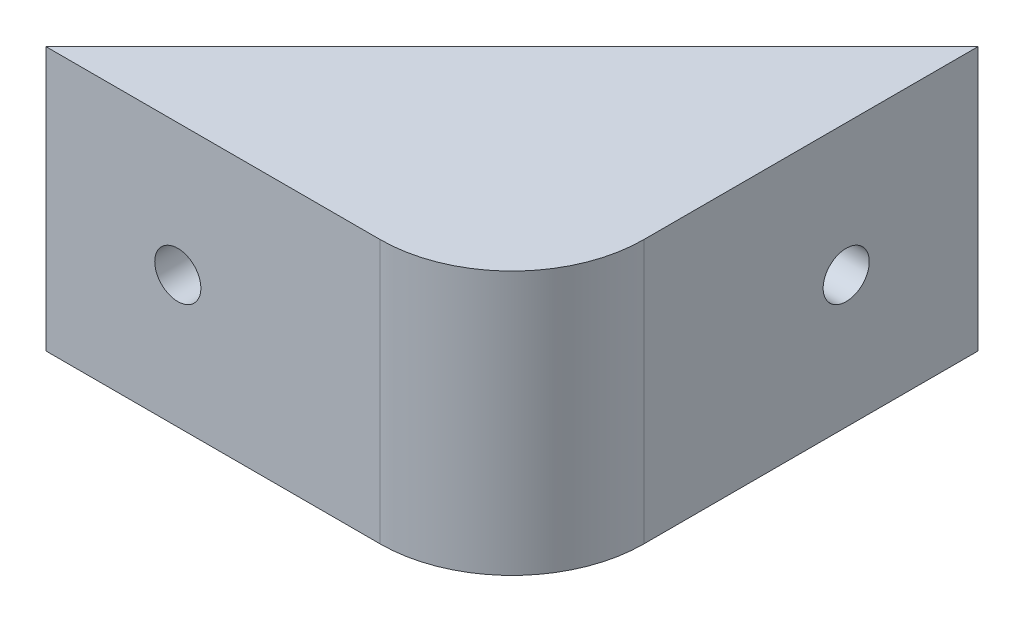
ISO-10303-21;
HEADER;
FILE_DESCRIPTION(('STEP AP214'),'2;1');
FILE_NAME('part.step','',(''),(''),'','','');
FILE_SCHEMA(('AUTOMOTIVE_DESIGN { 1 0 10303 214 1 1 1 1 }'));
ENDSEC;
DATA;
#1=APPLICATION_CONTEXT('core data for automotive mechanical design processes');
#2=APPLICATION_PROTOCOL_DEFINITION('international standard','automotive_design',2000,#1);
#3=PRODUCT_CONTEXT('',#1,'mechanical');
#4=PRODUCT('Part','Part','',(#3));
#5=PRODUCT_RELATED_PRODUCT_CATEGORY('part','',(#4));
#6=PRODUCT_DEFINITION_FORMATION('','',#4);
#7=PRODUCT_DEFINITION_CONTEXT('part definition',#1,'design');
#8=PRODUCT_DEFINITION('design','',#6,#7);
#9=PRODUCT_DEFINITION_SHAPE('','',#8);
#10=(LENGTH_UNIT() NAMED_UNIT(*) SI_UNIT(.MILLI.,.METRE.));
#11=(NAMED_UNIT(*) PLANE_ANGLE_UNIT() SI_UNIT($,.RADIAN.));
#12=(NAMED_UNIT(*) SI_UNIT($,.STERADIAN.) SOLID_ANGLE_UNIT());
#13=UNCERTAINTY_MEASURE_WITH_UNIT(LENGTH_MEASURE(1.E-05),#10,'distance_accuracy_value','');
#14=(GEOMETRIC_REPRESENTATION_CONTEXT(3) GLOBAL_UNCERTAINTY_ASSIGNED_CONTEXT((#13)) GLOBAL_UNIT_ASSIGNED_CONTEXT((#10,
#11,#12)) REPRESENTATION_CONTEXT('',''));
#15=CARTESIAN_POINT('',(0.,0.,0.));
#16=DIRECTION('',(0.,0.,1.));
#17=DIRECTION('',(1.,0.,0.));
#18=AXIS2_PLACEMENT_3D('',#15,#16,#17);
#19=CARTESIAN_POINT('',(-35.3553390593276,10.,0.));
#20=DIRECTION('',(0.,0.,-1.));
#21=DIRECTION('',(-1.,0.,0.));
#22=AXIS2_PLACEMENT_3D('',#19,#20,#21);
#23=PLANE('',#22);
#24=CARTESIAN_POINT('',(-25.3553390593276,0.,0.));
#25=DIRECTION('',(0.,0.,-1.));
#26=DIRECTION('',(-1.,0.,0.));
#27=AXIS2_PLACEMENT_3D('',#24,#25,#26);
#28=CIRCLE('',#27,1.75);
#29=CARTESIAN_POINT('',(-27.1053390593276,0.,0.));
#30=VERTEX_POINT('',#29);
#31=EDGE_CURVE('E284',#30,#30,#28,.T.);
#32=ORIENTED_EDGE('',*,*,#31,.T.);
#33=EDGE_LOOP('',(#32));
#34=FACE_BOUND('',#33,.T.);
#35=DIRECTION('',(1.,0.,0.));
#36=VECTOR('',#35,1.);
#37=CARTESIAN_POINT('',(-35.3553390593276,-10.,0.));
#38=LINE('',#37,#36);
#39=CARTESIAN_POINT('',(-35.3553390593276,-10.,0.));
#40=VERTEX_POINT('',#39);
#41=CARTESIAN_POINT('',(-10.,-10.,0.));
#42=VERTEX_POINT('',#41);
#43=EDGE_CURVE('E124',#40,#42,#38,.T.);
#44=ORIENTED_EDGE('',*,*,#43,.T.);
#45=DIRECTION('',(0.,-1.,0.));
#46=VECTOR('',#45,1.);
#47=CARTESIAN_POINT('',(-10.,10.,0.));
#48=LINE('',#47,#46);
#49=CARTESIAN_POINT('',(-10.,10.,0.));
#50=VERTEX_POINT('',#49);
#51=EDGE_CURVE('E57',#42,#50,#48,.F.);
#52=ORIENTED_EDGE('',*,*,#51,.T.);
#53=DIRECTION('',(1.,0.,0.));
#54=VECTOR('',#53,1.);
#55=CARTESIAN_POINT('',(-35.3553390593276,10.,0.));
#56=LINE('',#55,#54);
#57=CARTESIAN_POINT('',(-35.3553390593276,10.,0.));
#58=VERTEX_POINT('',#57);
#59=EDGE_CURVE('E128',#58,#50,#56,.T.);
#60=ORIENTED_EDGE('',*,*,#59,.F.);
#61=DIRECTION('',(0.,-1.,0.));
#62=VECTOR('',#61,1.);
#63=CARTESIAN_POINT('',(-35.3553390593276,10.,0.));
#64=LINE('',#63,#62);
#65=EDGE_CURVE('E135',#58,#40,#64,.T.);
#66=ORIENTED_EDGE('',*,*,#65,.T.);
#67=EDGE_LOOP('',(#44,#52,#60,#66));
#68=FACE_BOUND('',#67,.T.);
#69=ADVANCED_FACE('F34',(#34,#68),#23,.F.);
#70=CARTESIAN_POINT('',(0.,10.,0.));
#71=DIRECTION('',(-1.,0.,0.));
#72=DIRECTION('',(0.,0.,1.));
#73=AXIS2_PLACEMENT_3D('',#70,#71,#72);
#74=PLANE('',#73);
#75=CARTESIAN_POINT('',(0.,0.,-25.3553390593272));
#76=DIRECTION('',(-1.,0.,0.));
#77=DIRECTION('',(0.,0.,1.));
#78=AXIS2_PLACEMENT_3D('',#75,#76,#77);
#79=CIRCLE('',#78,1.75);
#80=CARTESIAN_POINT('',(0.,0.,-23.6053390593272));
#81=VERTEX_POINT('',#80);
#82=EDGE_CURVE('E112',#81,#81,#79,.T.);
#83=ORIENTED_EDGE('',*,*,#82,.T.);
#84=EDGE_LOOP('',(#83));
#85=FACE_BOUND('',#84,.T.);
#86=DIRECTION('',(0.,0.,-1.));
#87=VECTOR('',#86,1.);
#88=CARTESIAN_POINT('',(0.,10.,0.));
#89=LINE('',#88,#87);
#90=CARTESIAN_POINT('',(0.,10.,-10.));
#91=VERTEX_POINT('',#90);
#92=CARTESIAN_POINT('',(0.,10.,-35.3553390593272));
#93=VERTEX_POINT('',#92);
#94=EDGE_CURVE('E130',#91,#93,#89,.T.);
#95=ORIENTED_EDGE('',*,*,#94,.F.);
#96=DIRECTION('',(0.,-1.,0.));
#97=VECTOR('',#96,1.);
#98=CARTESIAN_POINT('',(0.,10.,-10.));
#99=LINE('',#98,#97);
#100=CARTESIAN_POINT('',(0.,-10.,-10.));
#101=VERTEX_POINT('',#100);
#102=EDGE_CURVE('E145',#91,#101,#99,.T.);
#103=ORIENTED_EDGE('',*,*,#102,.T.);
#104=DIRECTION('',(0.,0.,-1.));
#105=VECTOR('',#104,1.);
#106=CARTESIAN_POINT('',(0.,-10.,0.));
#107=LINE('',#106,#105);
#108=CARTESIAN_POINT('',(0.,-10.,-35.3553390593272));
#109=VERTEX_POINT('',#108);
#110=EDGE_CURVE('E137',#101,#109,#107,.T.);
#111=ORIENTED_EDGE('',*,*,#110,.T.);
#112=DIRECTION('',(0.,-1.,0.));
#113=VECTOR('',#112,1.);
#114=CARTESIAN_POINT('',(0.,10.,-35.3553390593272));
#115=LINE('',#114,#113);
#116=EDGE_CURVE('E142',#93,#109,#115,.T.);
#117=ORIENTED_EDGE('',*,*,#116,.F.);
#118=EDGE_LOOP('',(#95,#103,#111,#117));
#119=FACE_BOUND('',#118,.T.);
#120=ADVANCED_FACE('F183',(#85,#119),#74,.F.);
#121=CARTESIAN_POINT('',(0.,10.,-35.3553390593272));
#122=DIRECTION('',(0.707106781186544,0.,0.707106781186551));
#123=DIRECTION('',(0.707106781186551,0.,-0.707106781186544));
#124=AXIS2_PLACEMENT_3D('',#121,#122,#123);
#125=PLANE('',#124);
#126=DIRECTION('',(0.,1.,0.));
#127=VECTOR('',#126,1.);
#128=CARTESIAN_POINT('',(-5.,10.,-30.3553390593272));
#129=LINE('',#128,#127);
#130=CARTESIAN_POINT('',(-5.,-7.5,-30.3553390593272));
#131=VERTEX_POINT('',#130);
#132=CARTESIAN_POINT('',(-5.,7.5,-30.3553390593272));
#133=VERTEX_POINT('',#132);
#134=EDGE_CURVE('E11',#131,#133,#129,.T.);
#135=ORIENTED_EDGE('',*,*,#134,.T.);
#136=DIRECTION('',(-0.707106781186551,0.,0.707106781186544));
#137=VECTOR('',#136,1.);
#138=CARTESIAN_POINT('',(0.,7.5,-35.3553390593272));
#139=LINE('',#138,#137);
#140=CARTESIAN_POINT('',(-30.3553390593275,7.5,-5.));
#141=VERTEX_POINT('',#140);
#142=EDGE_CURVE('E42',#133,#141,#139,.T.);
#143=ORIENTED_EDGE('',*,*,#142,.T.);
#144=DIRECTION('',(0.,-1.,0.));
#145=VECTOR('',#144,1.);
#146=CARTESIAN_POINT('',(-30.3553390593275,10.,-5.));
#147=LINE('',#146,#145);
#148=CARTESIAN_POINT('',(-30.3553390593275,-7.5,-5.));
#149=VERTEX_POINT('',#148);
#150=EDGE_CURVE('E153',#141,#149,#147,.T.);
#151=ORIENTED_EDGE('',*,*,#150,.T.);
#152=DIRECTION('',(0.707106781186551,0.,-0.707106781186544));
#153=VECTOR('',#152,1.);
#154=CARTESIAN_POINT('',(0.,-7.5,-35.3553390593272));
#155=LINE('',#154,#153);
#156=EDGE_CURVE('E115',#149,#131,#155,.T.);
#157=ORIENTED_EDGE('',*,*,#156,.T.);
#158=EDGE_LOOP('',(#135,#143,#151,#157));
#159=FACE_BOUND('',#158,.T.);
#160=DIRECTION('',(-0.707106781186551,0.,0.707106781186544));
#161=VECTOR('',#160,1.);
#162=CARTESIAN_POINT('',(0.,-10.,-35.3553390593272));
#163=LINE('',#162,#161);
#164=EDGE_CURVE('E131',#109,#40,#163,.T.);
#165=ORIENTED_EDGE('',*,*,#164,.T.);
#166=ORIENTED_EDGE('',*,*,#65,.F.);
#167=DIRECTION('',(-0.707106781186551,0.,0.707106781186544));
#168=VECTOR('',#167,1.);
#169=CARTESIAN_POINT('',(0.,10.,-35.3553390593272));
#170=LINE('',#169,#168);
#171=EDGE_CURVE('E133',#93,#58,#170,.T.);
#172=ORIENTED_EDGE('',*,*,#171,.F.);
#173=ORIENTED_EDGE('',*,*,#116,.T.);
#174=EDGE_LOOP('',(#165,#166,#172,#173));
#175=FACE_BOUND('',#174,.T.);
#176=ADVANCED_FACE('F156',(#159,#175),#125,.F.);
#177=CARTESIAN_POINT('',(0.,10.,0.));
#178=DIRECTION('',(0.,1.,0.));
#179=DIRECTION('',(0.,0.,1.));
#180=AXIS2_PLACEMENT_3D('',#177,#178,#179);
#181=PLANE('',#180);
#182=ORIENTED_EDGE('',*,*,#59,.T.);
#183=CARTESIAN_POINT('',(-10.,10.,-10.));
#184=DIRECTION('',(0.,1.,0.));
#185=DIRECTION('',(0.,0.,1.));
#186=AXIS2_PLACEMENT_3D('',#183,#184,#185);
#187=CIRCLE('',#186,10.);
#188=EDGE_CURVE('E151',#50,#91,#187,.T.);
#189=ORIENTED_EDGE('',*,*,#188,.T.);
#190=ORIENTED_EDGE('',*,*,#94,.T.);
#191=ORIENTED_EDGE('',*,*,#171,.T.);
#192=EDGE_LOOP('',(#182,#189,#190,#191));
#193=FACE_BOUND('',#192,.T.);
#194=ADVANCED_FACE('F194',(#193),#181,.T.);
#195=CARTESIAN_POINT('',(0.,-10.,0.));
#196=DIRECTION('',(0.,1.,0.));
#197=DIRECTION('',(0.,0.,1.));
#198=AXIS2_PLACEMENT_3D('',#195,#196,#197);
#199=PLANE('',#198);
#200=ORIENTED_EDGE('',*,*,#110,.F.);
#201=CARTESIAN_POINT('',(-10.,-10.,-10.));
#202=DIRECTION('',(0.,1.,0.));
#203=DIRECTION('',(0.,0.,1.));
#204=AXIS2_PLACEMENT_3D('',#201,#202,#203);
#205=CIRCLE('',#204,10.);
#206=EDGE_CURVE('E148',#101,#42,#205,.F.);
#207=ORIENTED_EDGE('',*,*,#206,.T.);
#208=ORIENTED_EDGE('',*,*,#43,.F.);
#209=ORIENTED_EDGE('',*,*,#164,.F.);
#210=EDGE_LOOP('',(#200,#207,#208,#209));
#211=FACE_BOUND('',#210,.T.);
#212=ADVANCED_FACE('F195',(#211),#199,.F.);
#213=CARTESIAN_POINT('',(-10.,10.,-10.));
#214=DIRECTION('',(0.,-1.,0.));
#215=DIRECTION('',(0.,0.,-1.));
#216=AXIS2_PLACEMENT_3D('',#213,#214,#215);
#217=CYLINDRICAL_SURFACE('',#216,10.);
#218=ORIENTED_EDGE('',*,*,#188,.F.);
#219=ORIENTED_EDGE('',*,*,#51,.F.);
#220=ORIENTED_EDGE('',*,*,#206,.F.);
#221=ORIENTED_EDGE('',*,*,#102,.F.);
#222=EDGE_LOOP('',(#218,#219,#220,#221));
#223=FACE_BOUND('',#222,.T.);
#224=ADVANCED_FACE('F36',(#223),#217,.T.);
#225=CARTESIAN_POINT('',(-35.3553390593276,7.5,-35.3553390593272));
#226=DIRECTION('',(0.,1.,0.));
#227=DIRECTION('',(0.,0.,1.));
#228=AXIS2_PLACEMENT_3D('',#225,#226,#227);
#229=PLANE('',#228);
#230=DIRECTION('',(0.,0.,1.));
#231=VECTOR('',#230,1.);
#232=CARTESIAN_POINT('',(-5.,7.5,-10.));
#233=LINE('',#232,#231);
#234=CARTESIAN_POINT('',(-5.,7.5,-10.));
#235=VERTEX_POINT('',#234);
#236=EDGE_CURVE('E117',#133,#235,#233,.T.);
#237=ORIENTED_EDGE('',*,*,#236,.T.);
#238=CARTESIAN_POINT('',(-10.,7.5,-10.));
#239=DIRECTION('',(0.,-1.,0.));
#240=DIRECTION('',(0.,0.,-1.));
#241=AXIS2_PLACEMENT_3D('',#238,#239,#240);
#242=CIRCLE('',#241,5.);
#243=CARTESIAN_POINT('',(-10.,7.5,-5.));
#244=VERTEX_POINT('',#243);
#245=EDGE_CURVE('E111',#235,#244,#242,.T.);
#246=ORIENTED_EDGE('',*,*,#245,.T.);
#247=DIRECTION('',(-1.,0.,0.));
#248=VECTOR('',#247,1.);
#249=CARTESIAN_POINT('',(-35.3553390593276,7.5,-5.));
#250=LINE('',#249,#248);
#251=EDGE_CURVE('E122',#244,#141,#250,.T.);
#252=ORIENTED_EDGE('',*,*,#251,.T.);
#253=ORIENTED_EDGE('',*,*,#142,.F.);
#254=EDGE_LOOP('',(#237,#246,#252,#253));
#255=FACE_BOUND('',#254,.T.);
#256=ADVANCED_FACE('F162',(#255),#229,.F.);
#257=CARTESIAN_POINT('',(-35.3553390593276,-7.5,-35.3553390593272));
#258=DIRECTION('',(0.,-1.,0.));
#259=DIRECTION('',(0.,0.,-1.));
#260=AXIS2_PLACEMENT_3D('',#257,#258,#259);
#261=PLANE('',#260);
#262=DIRECTION('',(1.,0.,0.));
#263=VECTOR('',#262,1.);
#264=CARTESIAN_POINT('',(-35.3553390593276,-7.5,-5.));
#265=LINE('',#264,#263);
#266=CARTESIAN_POINT('',(-10.,-7.5,-5.));
#267=VERTEX_POINT('',#266);
#268=EDGE_CURVE('E49',#149,#267,#265,.T.);
#269=ORIENTED_EDGE('',*,*,#268,.T.);
#270=CARTESIAN_POINT('',(-10.,-7.5,-10.));
#271=DIRECTION('',(0.,-1.,0.));
#272=DIRECTION('',(0.,0.,-1.));
#273=AXIS2_PLACEMENT_3D('',#270,#271,#272);
#274=CIRCLE('',#273,5.);
#275=CARTESIAN_POINT('',(-5.,-7.5,-10.));
#276=VERTEX_POINT('',#275);
#277=EDGE_CURVE('E102',#276,#267,#274,.T.);
#278=ORIENTED_EDGE('',*,*,#277,.F.);
#279=DIRECTION('',(0.,0.,-1.));
#280=VECTOR('',#279,1.);
#281=CARTESIAN_POINT('',(-5.,-7.5,-10.));
#282=LINE('',#281,#280);
#283=EDGE_CURVE('E164',#276,#131,#282,.T.);
#284=ORIENTED_EDGE('',*,*,#283,.T.);
#285=ORIENTED_EDGE('',*,*,#156,.F.);
#286=EDGE_LOOP('',(#269,#278,#284,#285));
#287=FACE_BOUND('',#286,.T.);
#288=ADVANCED_FACE('F114',(#287),#261,.F.);
#289=CARTESIAN_POINT('',(0.,0.,-5.));
#290=DIRECTION('',(0.,0.,1.));
#291=DIRECTION('',(1.,0.,0.));
#292=AXIS2_PLACEMENT_3D('',#289,#290,#291);
#293=PLANE('',#292);
#294=CARTESIAN_POINT('',(-25.3553390593276,0.,-5.));
#295=DIRECTION('',(0.,0.,-1.));
#296=DIRECTION('',(-1.,0.,0.));
#297=AXIS2_PLACEMENT_3D('',#294,#295,#296);
#298=CIRCLE('',#297,1.75);
#299=CARTESIAN_POINT('',(-27.1053390593276,0.,-5.));
#300=VERTEX_POINT('',#299);
#301=EDGE_CURVE('E287',#300,#300,#298,.T.);
#302=ORIENTED_EDGE('',*,*,#301,.F.);
#303=EDGE_LOOP('',(#302));
#304=FACE_BOUND('',#303,.T.);
#305=ORIENTED_EDGE('',*,*,#251,.F.);
#306=DIRECTION('',(0.,1.,0.));
#307=VECTOR('',#306,1.);
#308=CARTESIAN_POINT('',(-10.,7.5,-5.));
#309=LINE('',#308,#307);
#310=EDGE_CURVE('E104',#267,#244,#309,.T.);
#311=ORIENTED_EDGE('',*,*,#310,.F.);
#312=ORIENTED_EDGE('',*,*,#268,.F.);
#313=ORIENTED_EDGE('',*,*,#150,.F.);
#314=EDGE_LOOP('',(#305,#311,#312,#313));
#315=FACE_BOUND('',#314,.T.);
#316=ADVANCED_FACE('F120',(#304,#315),#293,.F.);
#317=CARTESIAN_POINT('',(-5.,0.,0.));
#318=DIRECTION('',(1.,0.,0.));
#319=DIRECTION('',(0.,0.,-1.));
#320=AXIS2_PLACEMENT_3D('',#317,#318,#319);
#321=PLANE('',#320);
#322=CARTESIAN_POINT('',(-5.,0.,-25.3553390593272));
#323=DIRECTION('',(-1.,0.,0.));
#324=DIRECTION('',(0.,0.,1.));
#325=AXIS2_PLACEMENT_3D('',#322,#323,#324);
#326=CIRCLE('',#325,1.75);
#327=CARTESIAN_POINT('',(-5.,0.,-23.6053390593272));
#328=VERTEX_POINT('',#327);
#329=EDGE_CURVE('E289',#328,#328,#326,.T.);
#330=ORIENTED_EDGE('',*,*,#329,.F.);
#331=EDGE_LOOP('',(#330));
#332=FACE_BOUND('',#331,.T.);
#333=ORIENTED_EDGE('',*,*,#283,.F.);
#334=DIRECTION('',(0.,-1.,0.));
#335=VECTOR('',#334,1.);
#336=CARTESIAN_POINT('',(-5.,7.5,-10.));
#337=LINE('',#336,#335);
#338=EDGE_CURVE('E107',#235,#276,#337,.T.);
#339=ORIENTED_EDGE('',*,*,#338,.F.);
#340=ORIENTED_EDGE('',*,*,#236,.F.);
#341=ORIENTED_EDGE('',*,*,#134,.F.);
#342=EDGE_LOOP('',(#333,#339,#340,#341));
#343=FACE_BOUND('',#342,.T.);
#344=ADVANCED_FACE('F169',(#332,#343),#321,.F.);
#345=CARTESIAN_POINT('',(-10.,-7.5,-10.));
#346=DIRECTION('',(0.,-1.,0.));
#347=DIRECTION('',(0.,0.,-1.));
#348=AXIS2_PLACEMENT_3D('',#345,#346,#347);
#349=CYLINDRICAL_SURFACE('',#348,5.);
#350=ORIENTED_EDGE('',*,*,#310,.T.);
#351=ORIENTED_EDGE('',*,*,#245,.F.);
#352=ORIENTED_EDGE('',*,*,#338,.T.);
#353=ORIENTED_EDGE('',*,*,#277,.T.);
#354=EDGE_LOOP('',(#350,#351,#352,#353));
#355=FACE_BOUND('',#354,.T.);
#356=ADVANCED_FACE('F103',(#355),#349,.F.);
#357=CARTESIAN_POINT('',(0.,0.,-25.3553390593272));
#358=DIRECTION('',(-1.,0.,0.));
#359=DIRECTION('',(0.,0.,1.));
#360=AXIS2_PLACEMENT_3D('',#357,#358,#359);
#361=CYLINDRICAL_SURFACE('',#360,1.75);
#362=ORIENTED_EDGE('',*,*,#82,.F.);
#363=EDGE_LOOP('',(#362));
#364=FACE_BOUND('',#363,.T.);
#365=ORIENTED_EDGE('',*,*,#329,.T.);
#366=EDGE_LOOP('',(#365));
#367=FACE_BOUND('',#366,.T.);
#368=ADVANCED_FACE('F177',(#364,#367),#361,.F.);
#369=CARTESIAN_POINT('',(-25.3553390593276,0.,0.));
#370=DIRECTION('',(0.,0.,-1.));
#371=DIRECTION('',(-1.,0.,0.));
#372=AXIS2_PLACEMENT_3D('',#369,#370,#371);
#373=CYLINDRICAL_SURFACE('',#372,1.75);
#374=ORIENTED_EDGE('',*,*,#31,.F.);
#375=EDGE_LOOP('',(#374));
#376=FACE_BOUND('',#375,.T.);
#377=ORIENTED_EDGE('',*,*,#301,.T.);
#378=EDGE_LOOP('',(#377));
#379=FACE_BOUND('',#378,.T.);
#380=ADVANCED_FACE('F256',(#376,#379),#373,.F.);
#381=CLOSED_SHELL('',(#69,#120,#176,#194,#212,#224,#256,#288,#316,#344,#356,#368,#380));
#382=MANIFOLD_SOLID_BREP('B2',#381);
#383=ADVANCED_BREP_SHAPE_REPRESENTATION('',(#18,#382),#14);
#384=SHAPE_DEFINITION_REPRESENTATION(#9,#383);
ENDSEC;
END-ISO-10303-21;
